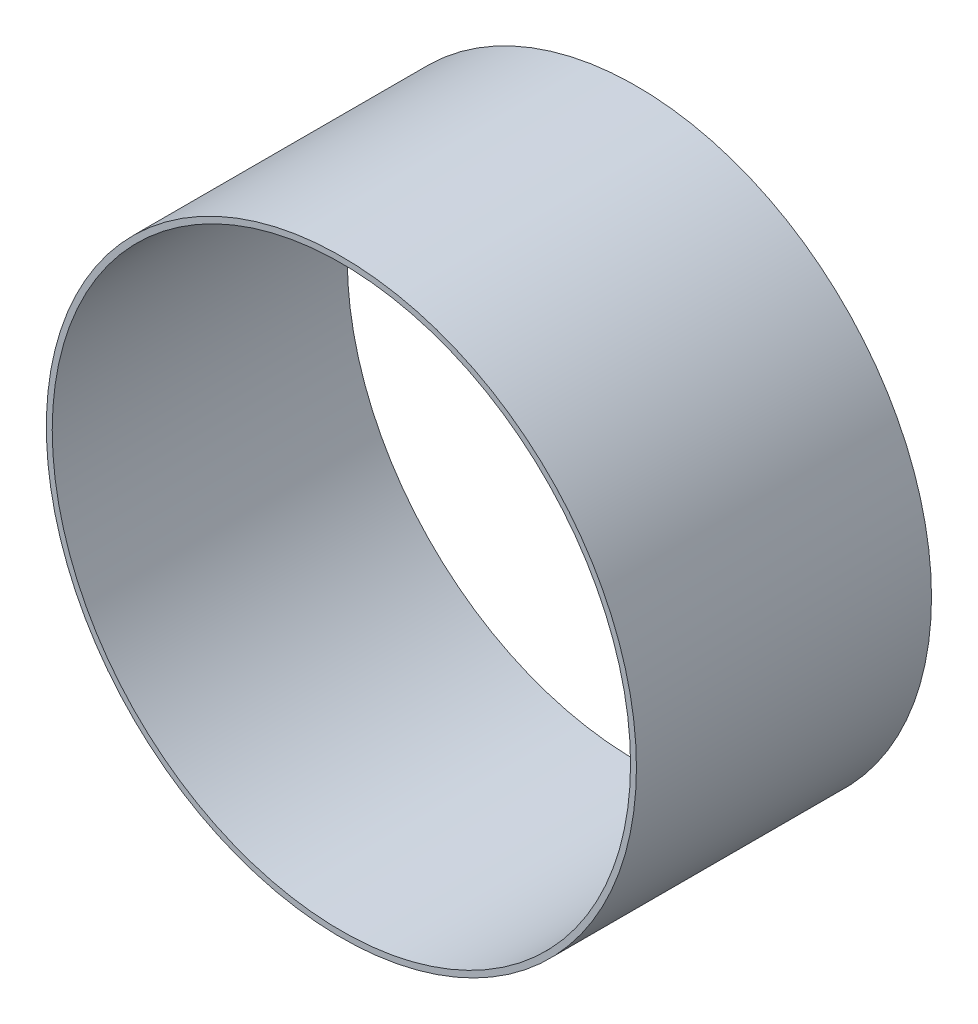
ISO-10303-21;
HEADER;
FILE_DESCRIPTION(('STEP AP214'),'2;1');
FILE_NAME('part.step','',(''),(''),'','','');
FILE_SCHEMA(('AUTOMOTIVE_DESIGN { 1 0 10303 214 1 1 1 1 }'));
ENDSEC;
DATA;
#1=APPLICATION_CONTEXT('core data for automotive mechanical design processes');
#2=APPLICATION_PROTOCOL_DEFINITION('international standard','automotive_design',2000,#1);
#3=PRODUCT_CONTEXT('',#1,'mechanical');
#4=PRODUCT('Part','Part','',(#3));
#5=PRODUCT_RELATED_PRODUCT_CATEGORY('part','',(#4));
#6=PRODUCT_DEFINITION_FORMATION('','',#4);
#7=PRODUCT_DEFINITION_CONTEXT('part definition',#1,'design');
#8=PRODUCT_DEFINITION('design','',#6,#7);
#9=PRODUCT_DEFINITION_SHAPE('','',#8);
#10=(LENGTH_UNIT() NAMED_UNIT(*) SI_UNIT(.MILLI.,.METRE.));
#11=(NAMED_UNIT(*) PLANE_ANGLE_UNIT() SI_UNIT($,.RADIAN.));
#12=(NAMED_UNIT(*) SI_UNIT($,.STERADIAN.) SOLID_ANGLE_UNIT());
#13=UNCERTAINTY_MEASURE_WITH_UNIT(LENGTH_MEASURE(1.E-05),#10,'distance_accuracy_value','');
#14=(GEOMETRIC_REPRESENTATION_CONTEXT(3) GLOBAL_UNCERTAINTY_ASSIGNED_CONTEXT((#13)) GLOBAL_UNIT_ASSIGNED_CONTEXT((#10,
#11,#12)) REPRESENTATION_CONTEXT('',''));
#15=CARTESIAN_POINT('',(0.,0.,0.));
#16=DIRECTION('',(0.,0.,1.));
#17=DIRECTION('',(1.,0.,0.));
#18=AXIS2_PLACEMENT_3D('',#15,#16,#17);
#19=CARTESIAN_POINT('',(0.,0.,100.));
#20=DIRECTION('',(0.,0.,1.));
#21=DIRECTION('',(1.,0.,0.));
#22=AXIS2_PLACEMENT_3D('',#19,#20,#21);
#23=PLANE('',#22);
#24=CARTESIAN_POINT('',(0.,0.,100.));
#25=DIRECTION('',(0.,0.,1.));
#26=DIRECTION('',(1.,0.,0.));
#27=AXIS2_PLACEMENT_3D('',#24,#25,#26);
#28=CIRCLE('',#27,100.);
#29=CARTESIAN_POINT('',(100.,0.,100.));
#30=VERTEX_POINT('',#29);
#31=EDGE_CURVE('E10',#30,#30,#28,.T.);
#32=ORIENTED_EDGE('',*,*,#31,.T.);
#33=EDGE_LOOP('',(#32));
#34=FACE_BOUND('',#33,.T.);
#35=CARTESIAN_POINT('',(0.,0.,100.));
#36=DIRECTION('',(0.,0.,1.));
#37=DIRECTION('',(1.,0.,0.));
#38=AXIS2_PLACEMENT_3D('',#35,#36,#37);
#39=CIRCLE('',#38,98.);
#40=CARTESIAN_POINT('',(98.,0.,100.));
#41=VERTEX_POINT('',#40);
#42=EDGE_CURVE('E45',#41,#41,#39,.T.);
#43=ORIENTED_EDGE('',*,*,#42,.F.);
#44=EDGE_LOOP('',(#43));
#45=FACE_BOUND('',#44,.T.);
#46=ADVANCED_FACE('F34',(#34,#45),#23,.T.);
#47=CARTESIAN_POINT('',(0.,0.,0.));
#48=DIRECTION('',(0.,0.,1.));
#49=DIRECTION('',(1.,0.,0.));
#50=AXIS2_PLACEMENT_3D('',#47,#48,#49);
#51=PLANE('',#50);
#52=CARTESIAN_POINT('',(0.,0.,0.));
#53=DIRECTION('',(0.,0.,1.));
#54=DIRECTION('',(1.,0.,0.));
#55=AXIS2_PLACEMENT_3D('',#52,#53,#54);
#56=CIRCLE('',#55,100.);
#57=CARTESIAN_POINT('',(100.,0.,0.));
#58=VERTEX_POINT('',#57);
#59=EDGE_CURVE('E38',#58,#58,#56,.T.);
#60=ORIENTED_EDGE('',*,*,#59,.F.);
#61=EDGE_LOOP('',(#60));
#62=FACE_BOUND('',#61,.T.);
#63=CARTESIAN_POINT('',(0.,0.,0.));
#64=DIRECTION('',(0.,0.,1.));
#65=DIRECTION('',(1.,0.,0.));
#66=AXIS2_PLACEMENT_3D('',#63,#64,#65);
#67=CIRCLE('',#66,98.);
#68=CARTESIAN_POINT('',(98.,0.,0.));
#69=VERTEX_POINT('',#68);
#70=EDGE_CURVE('E47',#69,#69,#67,.T.);
#71=ORIENTED_EDGE('',*,*,#70,.T.);
#72=EDGE_LOOP('',(#71));
#73=FACE_BOUND('',#72,.T.);
#74=ADVANCED_FACE('F57',(#62,#73),#51,.F.);
#75=CARTESIAN_POINT('',(0.,0.,100.));
#76=DIRECTION('',(0.,0.,-1.));
#77=DIRECTION('',(-1.,0.,0.));
#78=AXIS2_PLACEMENT_3D('',#75,#76,#77);
#79=CYLINDRICAL_SURFACE('',#78,100.);
#80=ORIENTED_EDGE('',*,*,#31,.F.);
#81=EDGE_LOOP('',(#80));
#82=FACE_BOUND('',#81,.T.);
#83=ORIENTED_EDGE('',*,*,#59,.T.);
#84=EDGE_LOOP('',(#83));
#85=FACE_BOUND('',#84,.T.);
#86=ADVANCED_FACE('F36',(#82,#85),#79,.T.);
#87=CARTESIAN_POINT('',(0.,0.,100.));
#88=DIRECTION('',(0.,0.,-1.));
#89=DIRECTION('',(-1.,0.,0.));
#90=AXIS2_PLACEMENT_3D('',#87,#88,#89);
#91=CYLINDRICAL_SURFACE('',#90,98.);
#92=ORIENTED_EDGE('',*,*,#42,.T.);
#93=EDGE_LOOP('',(#92));
#94=FACE_BOUND('',#93,.T.);
#95=ORIENTED_EDGE('',*,*,#70,.F.);
#96=EDGE_LOOP('',(#95));
#97=FACE_BOUND('',#96,.T.);
#98=ADVANCED_FACE('F53',(#94,#97),#91,.F.);
#99=CLOSED_SHELL('',(#46,#74,#86,#98));
#100=MANIFOLD_SOLID_BREP('B2',#99);
#101=ADVANCED_BREP_SHAPE_REPRESENTATION('',(#18,#100),#14);
#102=SHAPE_DEFINITION_REPRESENTATION(#9,#101);
ENDSEC;
END-ISO-10303-21;
